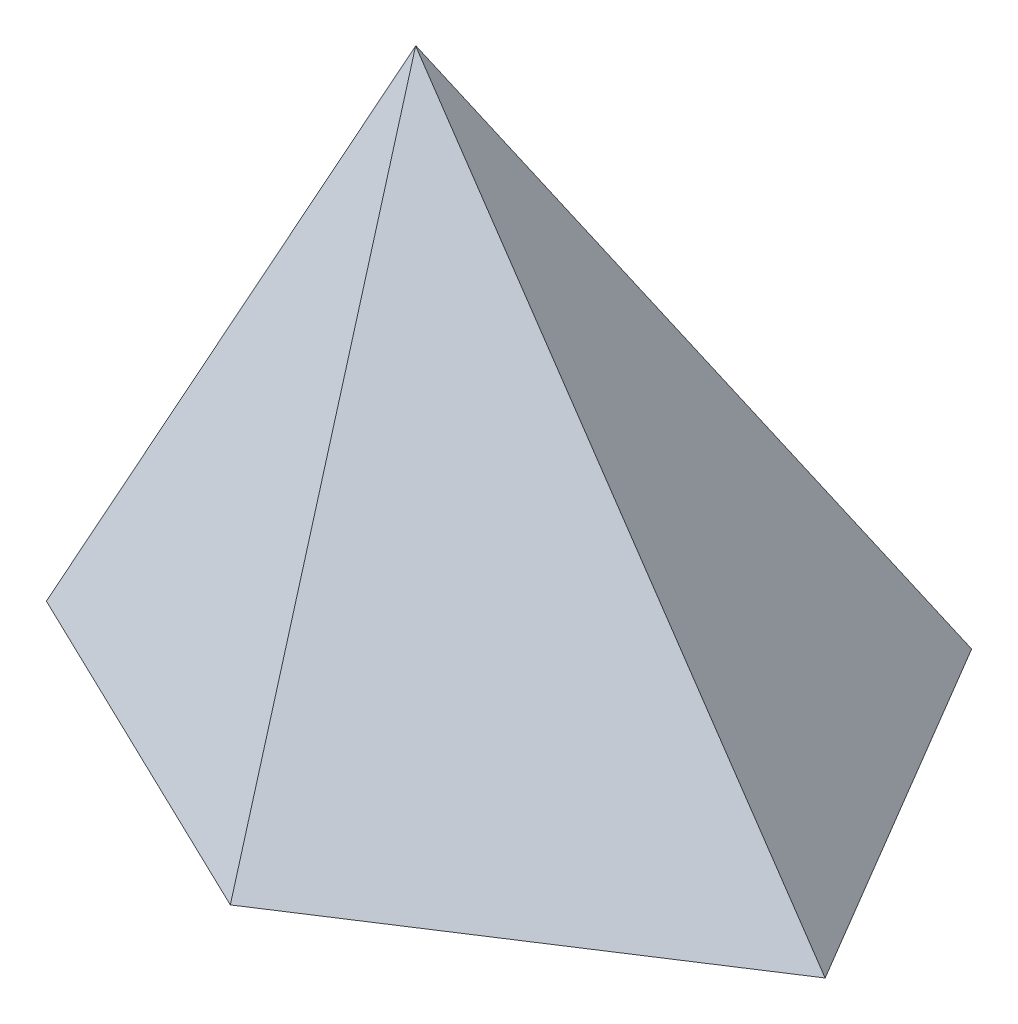
ISO-10303-21;
HEADER;
FILE_DESCRIPTION(('STEP AP214'),'2;1');
FILE_NAME('part.step','',(''),(''),'','','');
FILE_SCHEMA(('AUTOMOTIVE_DESIGN { 1 0 10303 214 1 1 1 1 }'));
ENDSEC;
DATA;
#1=APPLICATION_CONTEXT('core data for automotive mechanical design processes');
#2=APPLICATION_PROTOCOL_DEFINITION('international standard','automotive_design',2000,#1);
#3=PRODUCT_CONTEXT('',#1,'mechanical');
#4=PRODUCT('Part','Part','',(#3));
#5=PRODUCT_RELATED_PRODUCT_CATEGORY('part','',(#4));
#6=PRODUCT_DEFINITION_FORMATION('','',#4);
#7=PRODUCT_DEFINITION_CONTEXT('part definition',#1,'design');
#8=PRODUCT_DEFINITION('design','',#6,#7);
#9=PRODUCT_DEFINITION_SHAPE('','',#8);
#10=(LENGTH_UNIT() NAMED_UNIT(*) SI_UNIT(.MILLI.,.METRE.));
#11=(NAMED_UNIT(*) PLANE_ANGLE_UNIT() SI_UNIT($,.RADIAN.));
#12=(NAMED_UNIT(*) SI_UNIT($,.STERADIAN.) SOLID_ANGLE_UNIT());
#13=UNCERTAINTY_MEASURE_WITH_UNIT(LENGTH_MEASURE(1.E-05),#10,'distance_accuracy_value','');
#14=(GEOMETRIC_REPRESENTATION_CONTEXT(3) GLOBAL_UNCERTAINTY_ASSIGNED_CONTEXT((#13)) GLOBAL_UNIT_ASSIGNED_CONTEXT((#10,
#11,#12)) REPRESENTATION_CONTEXT('',''));
#15=CARTESIAN_POINT('',(0.,0.,0.));
#16=DIRECTION('',(0.,0.,1.));
#17=DIRECTION('',(1.,0.,0.));
#18=AXIS2_PLACEMENT_3D('',#15,#16,#17);
#19=CARTESIAN_POINT('',(-287.960399380742,128.590012854081,-66.1977929610898));
#20=DIRECTION('',(-0.893620414617014,0.39905021957667,-0.205429980371726));
#21=DIRECTION('',(-0.40774671663024,-0.913095074500602,0.));
#22=AXIS2_PLACEMENT_3D('',#19,#20,#21);
#23=PLANE('',#22);
#24=DIRECTION('',(0.299025702999702,0.870672288295742,0.390529634393333));
#25=VECTOR('',#24,1.);
#26=CARTESIAN_POINT('',(-210.378142615808,195.243932005802,-274.204566396701));
#27=LINE('',#26,#25);
#28=CARTESIAN_POINT('',(-277.433169873814,0.,-361.778895347715));
#29=VERTEX_POINT('',#28);
#30=CARTESIAN_POINT('',(-0.542446464021518,806.221931227455,-0.157697252113231));
#31=VERTEX_POINT('',#30);
#32=EDGE_CURVE('E123',#29,#31,#27,.T.);
#33=ORIENTED_EDGE('',*,*,#32,.F.);
#34=DIRECTION('',(-0.224041299098724,0.,0.974579651079457));
#35=VECTOR('',#34,1.);
#36=CARTESIAN_POINT('',(-342.500557244312,0.,-78.7357602860482));
#37=LINE('',#36,#35);
#38=CARTESIAN_POINT('',(-390.528039565445,0.,130.183787810883));
#39=VERTEX_POINT('',#38);
#40=EDGE_CURVE('E117',#29,#39,#37,.T.);
#41=ORIENTED_EDGE('',*,*,#40,.T.);
#42=DIRECTION('',(-0.430788756422881,-0.89103859344048,0.143077854118791));
#43=VECTOR('',#42,1.);
#44=CARTESIAN_POINT('',(-310.03020398189,166.500813041099,103.448044584576));
#45=LINE('',#44,#43);
#46=CARTESIAN_POINT('',(-0.545996938341231,806.6344479715,0.659066071916764));
#47=VERTEX_POINT('',#46);
#48=EDGE_CURVE('E120',#47,#39,#45,.T.);
#49=ORIENTED_EDGE('',*,*,#48,.F.);
#50=DIRECTION('',(0.432399730338875,0.642761243498891,-0.632367343447325));
#51=VECTOR('',#50,1.);
#52=CARTESIAN_POINT('',(-224.451441518387,473.799499458344,328.111840063034));
#53=LINE('',#52,#51);
#54=CARTESIAN_POINT('',(-0.484077545632733,806.726491011913,0.568511432013918));
#55=VERTEX_POINT('',#54);
#56=EDGE_CURVE('E80',#47,#55,#53,.T.);
#57=ORIENTED_EDGE('',*,*,#56,.T.);
#58=DIRECTION('',(0.0658635966773794,0.569346204460679,0.819455237397955));
#59=VECTOR('',#58,1.);
#60=CARTESIAN_POINT('',(-30.7642504434512,544.974895601286,-376.168373921759));
#61=LINE('',#60,#59);
#62=EDGE_CURVE('E13',#31,#55,#61,.T.);
#63=ORIENTED_EDGE('',*,*,#62,.F.);
#64=EDGE_LOOP('',(#33,#41,#49,#57,#63));
#65=FACE_BOUND('',#64,.T.);
#66=ADVANCED_FACE('F71',(#65),#23,.T.);
#67=CARTESIAN_POINT('',(0.,0.,0.));
#68=DIRECTION('',(0.,1.,0.));
#69=DIRECTION('',(0.,0.,1.));
#70=AXIS2_PLACEMENT_3D('',#67,#68,#69);
#71=PLANE('',#70);
#72=DIRECTION('',(-0.224041299098725,0.,0.974579651079457));
#73=VECTOR('',#72,1.);
#74=CARTESIAN_POINT('',(-386.774498518201,0.,128.459400229872));
#75=LINE('',#74,#73);
#76=CARTESIAN_POINT('',(-274.753848968838,0.,-358.830425309856));
#77=VERTEX_POINT('',#76);
#78=CARTESIAN_POINT('',(-386.774498518201,0.,128.459400229872));
#79=VERTEX_POINT('',#78);
#80=EDGE_CURVE('E264',#77,#79,#75,.T.);
#81=ORIENTED_EDGE('',*,*,#80,.T.);
#82=DIRECTION('',(0.900844488029246,0.,0.434141921941806));
#83=VECTOR('',#82,1.);
#84=CARTESIAN_POINT('',(108.689969897885,1.15936766177292E-13,367.237457297865));
#85=LINE('',#84,#83);
#86=CARTESIAN_POINT('',(108.689969897885,0.,367.237457297865));
#87=VERTEX_POINT('',#86);
#88=EDGE_CURVE('E272',#79,#87,#85,.T.);
#89=ORIENTED_EDGE('',*,*,#88,.T.);
#90=DIRECTION('',(0.838821465059352,0.,-0.544406603335854));
#91=VECTOR('',#90,1.);
#92=CARTESIAN_POINT('',(611.982848933496,1.96840636348633E-13,40.593495296353));
#93=LINE('',#92,#91);
#94=CARTESIAN_POINT('',(611.982848933496,1.96840636348633E-13,40.593495296353));
#95=VERTEX_POINT('',#94);
#96=EDGE_CURVE('E237',#87,#95,#93,.T.);
#97=ORIENTED_EDGE('',*,*,#96,.T.);
#98=DIRECTION('',(-0.50880941854285,0.,-0.860879187576333));
#99=VECTOR('',#98,1.);
#100=CARTESIAN_POINT('',(316.873386178643,-2.37450892026397E-13,-458.71643349792));
#101=LINE('',#100,#99);
#102=CARTESIAN_POINT('',(316.873386178644,-2.02148042276463E-13,-458.71643349792));
#103=VERTEX_POINT('',#102);
#104=EDGE_CURVE('E87',#95,#103,#101,.T.);
#105=ORIENTED_EDGE('',*,*,#104,.T.);
#106=DIRECTION('',(-0.98604539191247,0.,0.16647668031344));
#107=VECTOR('',#106,1.);
#108=CARTESIAN_POINT('',(-274.753848968838,0.,-358.830425309856));
#109=LINE('',#108,#107);
#110=EDGE_CURVE('E228',#103,#77,#109,.T.);
#111=ORIENTED_EDGE('',*,*,#110,.T.);
#112=EDGE_LOOP('',(#81,#89,#97,#105,#111));
#113=FACE_BOUND('',#112,.T.);
#114=DIRECTION('',(0.900844488029246,0.,0.434141921941806));
#115=VECTOR('',#114,1.);
#116=CARTESIAN_POINT('',(-124.520560588626,0.,258.380163221398));
#117=LINE('',#116,#115);
#118=CARTESIAN_POINT('',(109.045345397433,0.,370.942045624318));
#119=VERTEX_POINT('',#118);
#120=EDGE_CURVE('E133',#39,#119,#117,.T.);
#121=ORIENTED_EDGE('',*,*,#120,.F.);
#122=ORIENTED_EDGE('',*,*,#40,.F.);
#123=DIRECTION('',(-0.98604539191247,0.,0.16647668031344));
#124=VECTOR('',#123,1.);
#125=CARTESIAN_POINT('',(-67.0762123140509,0.,-397.294023010817));
#126=LINE('',#125,#124);
#127=CARTESIAN_POINT('',(318.79539523539,0.,-462.441758377693));
#128=VERTEX_POINT('',#127);
#129=EDGE_CURVE('E156',#128,#29,#126,.T.);
#130=ORIENTED_EDGE('',*,*,#129,.F.);
#131=DIRECTION('',(-0.50880941854285,0.,-0.860879187576333));
#132=VECTOR('',#131,1.);
#133=CARTESIAN_POINT('',(438.823733251144,0.,-259.360026099504));
#134=LINE('',#133,#132);
#135=CARTESIAN_POINT('',(616.644392803859,0.,41.5033214549334));
#136=VERTEX_POINT('',#135);
#137=EDGE_CURVE('E158',#136,#128,#134,.T.);
#138=ORIENTED_EDGE('',*,*,#137,.F.);
#139=DIRECTION('',(0.838821465059352,0.,-0.544406603335854));
#140=VECTOR('',#139,1.);
#141=CARTESIAN_POINT('',(201.71307533043,0.,310.799421486657));
#142=LINE('',#141,#140);
#143=EDGE_CURVE('E128',#119,#136,#142,.T.);
#144=ORIENTED_EDGE('',*,*,#143,.F.);
#145=EDGE_LOOP('',(#121,#122,#130,#138,#144));
#146=FACE_BOUND('',#145,.T.);
#147=ADVANCED_FACE('F134',(#113,#146),#71,.F.);
#148=CARTESIAN_POINT('',(166.608376482695,140.477787242852,256.710116291806));
#149=DIRECTION('',(0.494771613763842,0.417172431299329,0.762343894038203));
#150=DIRECTION('',(0.838821465059352,0.,-0.544406603335854));
#151=AXIS2_PLACEMENT_3D('',#148,#149,#150);
#152=PLANE('',#151);
#153=DIRECTION('',(-0.607093925036111,0.793609070703984,-0.0402692075984568));
#154=VECTOR('',#153,1.);
#155=CARTESIAN_POINT('',(388.357424967442,298.422700223383,26.3607958576298));
#156=LINE('',#155,#154);
#157=EDGE_CURVE('E148',#136,#55,#156,.T.);
#158=ORIENTED_EDGE('',*,*,#157,.T.);
#159=ORIENTED_EDGE('',*,*,#56,.F.);
#160=DIRECTION('',(0.122543782331724,-0.901969390160693,0.414046181753899));
#161=VECTOR('',#160,1.);
#162=CARTESIAN_POINT('',(88.5866650162175,150.583759663834,301.817049362694));
#163=LINE('',#162,#161);
#164=EDGE_CURVE('E138',#47,#119,#163,.T.);
#165=ORIENTED_EDGE('',*,*,#164,.T.);
#166=ORIENTED_EDGE('',*,*,#143,.T.);
#167=EDGE_LOOP('',(#158,#159,#165,#166));
#168=FACE_BOUND('',#167,.T.);
#169=ADVANCED_FACE('F173',(#168),#152,.T.);
#170=CARTESIAN_POINT('',(-53.6844066093591,161.06094440421,-317.974034892142));
#171=DIRECTION('',(0.148933782761984,-0.446822778165061,0.882138386686048));
#172=DIRECTION('',(0.,-0.892087687779164,-0.451862321191782));
#173=AXIS2_PLACEMENT_3D('',#170,#171,#172);
#174=PLANE('',#173);
#175=ORIENTED_EDGE('',*,*,#129,.T.);
#176=ORIENTED_EDGE('',*,*,#32,.T.);
#177=DIRECTION('',(-0.324963391773541,0.820424575739754,0.470427794171731));
#178=VECTOR('',#177,1.);
#179=CARTESIAN_POINT('',(214.435907680742,263.473026405097,-311.367499633381));
#180=LINE('',#179,#178);
#181=EDGE_CURVE('E141',#128,#31,#180,.T.);
#182=ORIENTED_EDGE('',*,*,#181,.F.);
#183=EDGE_LOOP('',(#175,#176,#182));
#184=FACE_BOUND('',#183,.T.);
#185=ADVANCED_FACE('F178',(#184),#174,.F.);
#186=CARTESIAN_POINT('',(313.366046251264,230.320396083687,-185.210187544509));
#187=DIRECTION('',(-0.727483459997968,-0.534691874424436,0.429967923052253));
#188=DIRECTION('',(0.59223052606707,-0.805768579676771,0.));
#189=AXIS2_PLACEMENT_3D('',#186,#187,#188);
#190=PLANE('',#189);
#191=ORIENTED_EDGE('',*,*,#137,.T.);
#192=ORIENTED_EDGE('',*,*,#181,.T.);
#193=ORIENTED_EDGE('',*,*,#62,.T.);
#194=ORIENTED_EDGE('',*,*,#157,.F.);
#195=EDGE_LOOP('',(#191,#192,#193,#194));
#196=FACE_BOUND('',#195,.T.);
#197=ADVANCED_FACE('F175',(#196),#190,.F.);
#198=CARTESIAN_POINT('',(-110.615818778536,90.3354805486495,229.527823965463));
#199=DIRECTION('',(-0.409185099157324,0.334164977250939,0.849059080751446));
#200=DIRECTION('',(0.900844488029246,0.,0.434141921941806));
#201=AXIS2_PLACEMENT_3D('',#198,#199,#200);
#202=PLANE('',#201);
#203=ORIENTED_EDGE('',*,*,#48,.T.);
#204=ORIENTED_EDGE('',*,*,#120,.T.);
#205=ORIENTED_EDGE('',*,*,#164,.F.);
#206=EDGE_LOOP('',(#203,#204,#205));
#207=FACE_BOUND('',#206,.T.);
#208=ADVANCED_FACE('F73',(#207),#202,.T.);
#209=CARTESIAN_POINT('',(-285.279538136891,127.392862195351,-65.5815030199746));
#210=DIRECTION('',(-0.893620414617014,0.39905021957667,-0.205429980371726));
#211=DIRECTION('',(-0.40774671663024,-0.913095074500602,0.));
#212=AXIS2_PLACEMENT_3D('',#209,#210,#211);
#213=PLANE('',#212);
#214=DIRECTION('',(0.299025702999701,0.870672288295742,0.390529634393334));
#215=VECTOR('',#214,1.);
#216=CARTESIAN_POINT('',(-274.753848968838,0.,-358.830425309856));
#217=LINE('',#216,#215);
#218=CARTESIAN_POINT('',(0.,800.,0.));
#219=VERTEX_POINT('',#218);
#220=EDGE_CURVE('E232',#77,#219,#217,.T.);
#221=ORIENTED_EDGE('',*,*,#220,.T.);
#222=DIRECTION('',(-0.430788756422881,-0.89103859344048,0.143077854118791));
#223=VECTOR('',#222,1.);
#224=CARTESIAN_POINT('',(3.33762953845575E-13,800.,0.));
#225=LINE('',#224,#223);
#226=EDGE_CURVE('E240',#219,#79,#225,.T.);
#227=ORIENTED_EDGE('',*,*,#226,.T.);
#228=ORIENTED_EDGE('',*,*,#80,.F.);
#229=EDGE_LOOP('',(#221,#227,#228));
#230=FACE_BOUND('',#229,.T.);
#231=ADVANCED_FACE('F187',(#230),#213,.F.);
#232=CARTESIAN_POINT('',(165.124061641404,139.226269948954,254.423084609692));
#233=DIRECTION('',(0.494771613763842,0.417172431299329,0.762343894038203));
#234=DIRECTION('',(0.838821465059352,0.,-0.544406603335854));
#235=AXIS2_PLACEMENT_3D('',#232,#233,#234);
#236=PLANE('',#235);
#237=DIRECTION('',(-0.607093925036111,0.793609070703984,-0.0402692075984567));
#238=VECTOR('',#237,1.);
#239=CARTESIAN_POINT('',(611.982848933496,1.07796551838734E-13,40.5934952963531));
#240=LINE('',#239,#238);
#241=EDGE_CURVE('E239',#95,#219,#240,.T.);
#242=ORIENTED_EDGE('',*,*,#241,.F.);
#243=ORIENTED_EDGE('',*,*,#96,.F.);
#244=DIRECTION('',(0.122543782331724,-0.901969390160693,0.414046181753899));
#245=VECTOR('',#244,1.);
#246=CARTESIAN_POINT('',(0.,800.,-1.88528988143465E-13));
#247=LINE('',#246,#245);
#248=EDGE_CURVE('E129',#219,#87,#247,.T.);
#249=ORIENTED_EDGE('',*,*,#248,.F.);
#250=EDGE_LOOP('',(#242,#243,#249));
#251=FACE_BOUND('',#250,.T.);
#252=ADVANCED_FACE('F191',(#251),#236,.F.);
#253=CARTESIAN_POINT('',(-53.2376052610731,159.720476069715,-315.327619732084));
#254=DIRECTION('',(0.148933782761984,-0.446822778165061,0.882138386686048));
#255=DIRECTION('',(0.,-0.892087687779164,-0.451862321191782));
#256=AXIS2_PLACEMENT_3D('',#253,#254,#255);
#257=PLANE('',#256);
#258=ORIENTED_EDGE('',*,*,#110,.F.);
#259=DIRECTION('',(-0.324963391773541,0.820424575739754,0.47042779417173));
#260=VECTOR('',#259,1.);
#261=CARTESIAN_POINT('',(316.873386178643,-2.94582294366117E-13,-458.71643349792));
#262=LINE('',#261,#260);
#263=EDGE_CURVE('E229',#103,#219,#262,.T.);
#264=ORIENTED_EDGE('',*,*,#263,.T.);
#265=ORIENTED_EDGE('',*,*,#220,.F.);
#266=EDGE_LOOP('',(#258,#264,#265));
#267=FACE_BOUND('',#266,.T.);
#268=ADVANCED_FACE('F197',(#267),#257,.T.);
#269=CARTESIAN_POINT('',(311.18359587127,228.716320460414,-183.920283775353));
#270=DIRECTION('',(-0.727483459997968,-0.534691874424436,0.429967923052253));
#271=DIRECTION('',(0.59223052606707,-0.805768579676771,0.));
#272=AXIS2_PLACEMENT_3D('',#269,#270,#271);
#273=PLANE('',#272);
#274=ORIENTED_EDGE('',*,*,#104,.F.);
#275=ORIENTED_EDGE('',*,*,#241,.T.);
#276=ORIENTED_EDGE('',*,*,#263,.F.);
#277=EDGE_LOOP('',(#274,#275,#276));
#278=FACE_BOUND('',#277,.T.);
#279=ADVANCED_FACE('F211',(#278),#273,.T.);
#280=CARTESIAN_POINT('',(-109.388263481064,89.3329856168966,226.980646723208));
#281=DIRECTION('',(-0.409185099157324,0.334164977250939,0.849059080751446));
#282=DIRECTION('',(0.900844488029246,0.,0.434141921941806));
#283=AXIS2_PLACEMENT_3D('',#280,#281,#282);
#284=PLANE('',#283);
#285=ORIENTED_EDGE('',*,*,#226,.F.);
#286=ORIENTED_EDGE('',*,*,#248,.T.);
#287=ORIENTED_EDGE('',*,*,#88,.F.);
#288=EDGE_LOOP('',(#285,#286,#287));
#289=FACE_BOUND('',#288,.T.);
#290=ADVANCED_FACE('F207',(#289),#284,.F.);
#291=CLOSED_SHELL('',(#66,#147,#169,#185,#197,#208,#231,#252,#268,#279,#290));
#292=MANIFOLD_SOLID_BREP('B2',#291);
#293=ADVANCED_BREP_SHAPE_REPRESENTATION('',(#18,#292),#14);
#294=SHAPE_DEFINITION_REPRESENTATION(#9,#293);
ENDSEC;
END-ISO-10303-21;
